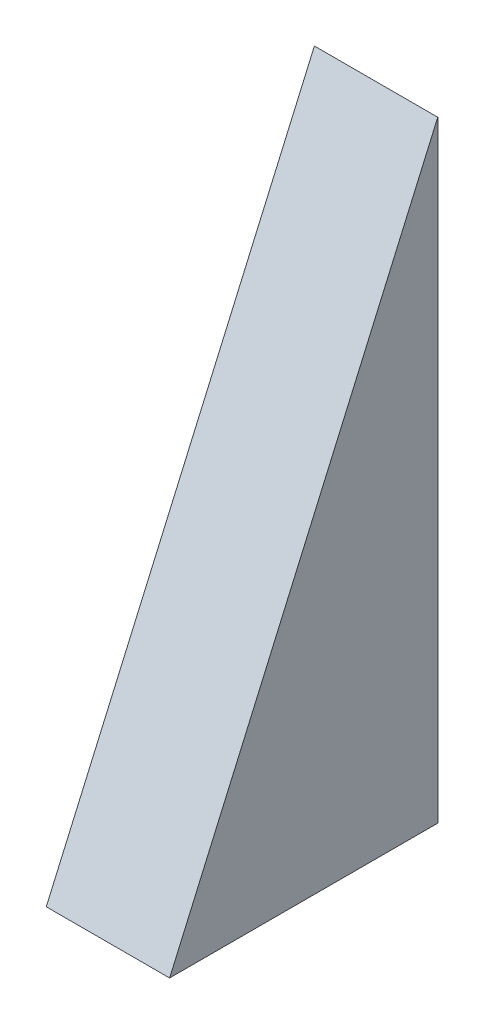
ISO-10303-21;
HEADER;
FILE_DESCRIPTION(('STEP AP214'),'2;1');
FILE_NAME('part.step','',(''),(''),'','','');
FILE_SCHEMA(('AUTOMOTIVE_DESIGN { 1 0 10303 214 1 1 1 1 }'));
ENDSEC;
DATA;
#1=APPLICATION_CONTEXT('core data for automotive mechanical design processes');
#2=APPLICATION_PROTOCOL_DEFINITION('international standard','automotive_design',2000,#1);
#3=PRODUCT_CONTEXT('',#1,'mechanical');
#4=PRODUCT('Part','Part','',(#3));
#5=PRODUCT_RELATED_PRODUCT_CATEGORY('part','',(#4));
#6=PRODUCT_DEFINITION_FORMATION('','',#4);
#7=PRODUCT_DEFINITION_CONTEXT('part definition',#1,'design');
#8=PRODUCT_DEFINITION('design','',#6,#7);
#9=PRODUCT_DEFINITION_SHAPE('','',#8);
#10=(LENGTH_UNIT() NAMED_UNIT(*) SI_UNIT(.MILLI.,.METRE.));
#11=(NAMED_UNIT(*) PLANE_ANGLE_UNIT() SI_UNIT($,.RADIAN.));
#12=(NAMED_UNIT(*) SI_UNIT($,.STERADIAN.) SOLID_ANGLE_UNIT());
#13=UNCERTAINTY_MEASURE_WITH_UNIT(LENGTH_MEASURE(1.E-05),#10,'distance_accuracy_value','');
#14=(GEOMETRIC_REPRESENTATION_CONTEXT(3) GLOBAL_UNCERTAINTY_ASSIGNED_CONTEXT((#13)) GLOBAL_UNIT_ASSIGNED_CONTEXT((#10,
#11,#12)) REPRESENTATION_CONTEXT('',''));
#15=CARTESIAN_POINT('',(0.,0.,0.));
#16=DIRECTION('',(0.,0.,1.));
#17=DIRECTION('',(1.,0.,0.));
#18=AXIS2_PLACEMENT_3D('',#15,#16,#17);
#19=CARTESIAN_POINT('',(23.,89.9446279186792,40.));
#20=DIRECTION('',(0.,-0.401661495085065,-0.915788208793949));
#21=DIRECTION('',(0.,0.915788208793949,-0.401661495085066));
#22=AXIS2_PLACEMENT_3D('',#19,#20,#21);
#23=PLANE('',#22);
#24=DIRECTION('',(0.,-0.915788208793949,0.401661495085066));
#25=VECTOR('',#24,1.);
#26=CARTESIAN_POINT('',(0.,89.9446279186792,40.));
#27=LINE('',#26,#25);
#28=CARTESIAN_POINT('',(0.,89.9446279186792,40.));
#29=VERTEX_POINT('',#28);
#30=CARTESIAN_POINT('',(0.,-24.0553720813208,90.));
#31=VERTEX_POINT('',#30);
#32=EDGE_CURVE('E79',#29,#31,#27,.T.);
#33=ORIENTED_EDGE('',*,*,#32,.T.);
#34=DIRECTION('',(-1.,0.,0.));
#35=VECTOR('',#34,1.);
#36=CARTESIAN_POINT('',(23.,-24.0553720813208,90.));
#37=LINE('',#36,#35);
#38=CARTESIAN_POINT('',(23.,-24.0553720813208,90.));
#39=VERTEX_POINT('',#38);
#40=EDGE_CURVE('E11',#39,#31,#37,.T.);
#41=ORIENTED_EDGE('',*,*,#40,.F.);
#42=DIRECTION('',(0.,-0.915788208793949,0.401661495085066));
#43=VECTOR('',#42,1.);
#44=CARTESIAN_POINT('',(23.,89.9446279186792,40.));
#45=LINE('',#44,#43);
#46=CARTESIAN_POINT('',(23.,89.9446279186792,40.));
#47=VERTEX_POINT('',#46);
#48=EDGE_CURVE('E72',#47,#39,#45,.T.);
#49=ORIENTED_EDGE('',*,*,#48,.F.);
#50=DIRECTION('',(-1.,0.,0.));
#51=VECTOR('',#50,1.);
#52=CARTESIAN_POINT('',(23.,89.9446279186792,40.));
#53=LINE('',#52,#51);
#54=EDGE_CURVE('E80',#47,#29,#53,.T.);
#55=ORIENTED_EDGE('',*,*,#54,.T.);
#56=EDGE_LOOP('',(#33,#41,#49,#55));
#57=FACE_BOUND('',#56,.T.);
#58=ADVANCED_FACE('F32',(#57),#23,.F.);
#59=CARTESIAN_POINT('',(23.,-24.0553720813208,90.));
#60=DIRECTION('',(0.,1.,0.));
#61=DIRECTION('',(0.,0.,1.));
#62=AXIS2_PLACEMENT_3D('',#59,#60,#61);
#63=PLANE('',#62);
#64=DIRECTION('',(0.,0.,-1.));
#65=VECTOR('',#64,1.);
#66=CARTESIAN_POINT('',(0.,-24.0553720813208,90.));
#67=LINE('',#66,#65);
#68=CARTESIAN_POINT('',(0.,-24.0553720813208,40.));
#69=VERTEX_POINT('',#68);
#70=EDGE_CURVE('E60',#31,#69,#67,.T.);
#71=ORIENTED_EDGE('',*,*,#70,.T.);
#72=DIRECTION('',(-1.,0.,0.));
#73=VECTOR('',#72,1.);
#74=CARTESIAN_POINT('',(23.,-24.0553720813208,40.));
#75=LINE('',#74,#73);
#76=CARTESIAN_POINT('',(23.,-24.0553720813208,40.));
#77=VERTEX_POINT('',#76);
#78=EDGE_CURVE('E40',#77,#69,#75,.T.);
#79=ORIENTED_EDGE('',*,*,#78,.F.);
#80=DIRECTION('',(0.,0.,-1.));
#81=VECTOR('',#80,1.);
#82=CARTESIAN_POINT('',(23.,-24.0553720813208,90.));
#83=LINE('',#82,#81);
#84=EDGE_CURVE('E68',#39,#77,#83,.T.);
#85=ORIENTED_EDGE('',*,*,#84,.F.);
#86=ORIENTED_EDGE('',*,*,#40,.T.);
#87=EDGE_LOOP('',(#71,#79,#85,#86));
#88=FACE_BOUND('',#87,.T.);
#89=ADVANCED_FACE('F69',(#88),#63,.F.);
#90=CARTESIAN_POINT('',(23.,-24.0553720813208,40.));
#91=DIRECTION('',(0.,0.,1.));
#92=DIRECTION('',(1.,0.,0.));
#93=AXIS2_PLACEMENT_3D('',#90,#91,#92);
#94=PLANE('',#93);
#95=DIRECTION('',(0.,1.,0.));
#96=VECTOR('',#95,1.);
#97=CARTESIAN_POINT('',(0.,-24.0553720813208,40.));
#98=LINE('',#97,#96);
#99=EDGE_CURVE('E65',#69,#29,#98,.T.);
#100=ORIENTED_EDGE('',*,*,#99,.T.);
#101=ORIENTED_EDGE('',*,*,#54,.F.);
#102=DIRECTION('',(0.,1.,0.));
#103=VECTOR('',#102,1.);
#104=CARTESIAN_POINT('',(23.,-24.0553720813208,40.));
#105=LINE('',#104,#103);
#106=EDGE_CURVE('E48',#77,#47,#105,.T.);
#107=ORIENTED_EDGE('',*,*,#106,.F.);
#108=ORIENTED_EDGE('',*,*,#78,.T.);
#109=EDGE_LOOP('',(#100,#101,#107,#108));
#110=FACE_BOUND('',#109,.T.);
#111=ADVANCED_FACE('F87',(#110),#94,.F.);
#112=CARTESIAN_POINT('',(23.,0.,0.));
#113=DIRECTION('',(1.,0.,0.));
#114=DIRECTION('',(0.,0.,-1.));
#115=AXIS2_PLACEMENT_3D('',#112,#113,#114);
#116=PLANE('',#115);
#117=ORIENTED_EDGE('',*,*,#48,.T.);
#118=ORIENTED_EDGE('',*,*,#84,.T.);
#119=ORIENTED_EDGE('',*,*,#106,.T.);
#120=EDGE_LOOP('',(#117,#118,#119));
#121=FACE_BOUND('',#120,.T.);
#122=ADVANCED_FACE('F75',(#121),#116,.T.);
#123=CARTESIAN_POINT('',(0.,0.,0.));
#124=DIRECTION('',(1.,0.,0.));
#125=DIRECTION('',(0.,0.,-1.));
#126=AXIS2_PLACEMENT_3D('',#123,#124,#125);
#127=PLANE('',#126);
#128=ORIENTED_EDGE('',*,*,#32,.F.);
#129=ORIENTED_EDGE('',*,*,#99,.F.);
#130=ORIENTED_EDGE('',*,*,#70,.F.);
#131=EDGE_LOOP('',(#128,#129,#130));
#132=FACE_BOUND('',#131,.T.);
#133=ADVANCED_FACE('F88',(#132),#127,.F.);
#134=CLOSED_SHELL('',(#58,#89,#111,#122,#133));
#135=MANIFOLD_SOLID_BREP('B2',#134);
#136=ADVANCED_BREP_SHAPE_REPRESENTATION('',(#18,#135),#14);
#137=SHAPE_DEFINITION_REPRESENTATION(#9,#136);
ENDSEC;
END-ISO-10303-21;
